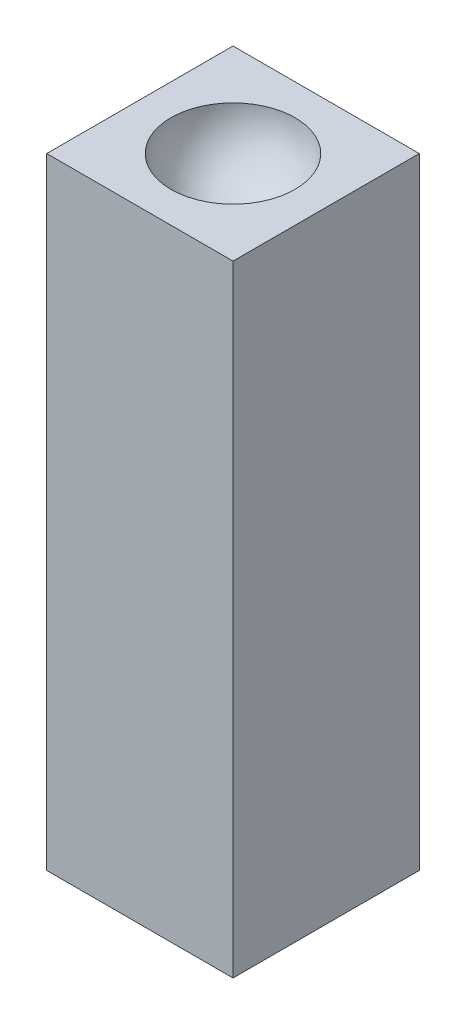
ISO-10303-21;
HEADER;
FILE_DESCRIPTION(('STEP AP214'),'2;1');
FILE_NAME('part.step','',(''),(''),'','','');
FILE_SCHEMA(('AUTOMOTIVE_DESIGN { 1 0 10303 214 1 1 1 1 }'));
ENDSEC;
DATA;
#1=APPLICATION_CONTEXT('core data for automotive mechanical design processes');
#2=APPLICATION_PROTOCOL_DEFINITION('international standard','automotive_design',2000,#1);
#3=PRODUCT_CONTEXT('',#1,'mechanical');
#4=PRODUCT('Part','Part','',(#3));
#5=PRODUCT_RELATED_PRODUCT_CATEGORY('part','',(#4));
#6=PRODUCT_DEFINITION_FORMATION('','',#4);
#7=PRODUCT_DEFINITION_CONTEXT('part definition',#1,'design');
#8=PRODUCT_DEFINITION('design','',#6,#7);
#9=PRODUCT_DEFINITION_SHAPE('','',#8);
#10=(LENGTH_UNIT() NAMED_UNIT(*) SI_UNIT(.MILLI.,.METRE.));
#11=(NAMED_UNIT(*) PLANE_ANGLE_UNIT() SI_UNIT($,.RADIAN.));
#12=(NAMED_UNIT(*) SI_UNIT($,.STERADIAN.) SOLID_ANGLE_UNIT());
#13=UNCERTAINTY_MEASURE_WITH_UNIT(LENGTH_MEASURE(1.E-05),#10,'distance_accuracy_value','');
#14=(GEOMETRIC_REPRESENTATION_CONTEXT(3) GLOBAL_UNCERTAINTY_ASSIGNED_CONTEXT((#13)) GLOBAL_UNIT_ASSIGNED_CONTEXT((#10,
#11,#12)) REPRESENTATION_CONTEXT('',''));
#15=CARTESIAN_POINT('',(0.,0.,0.));
#16=DIRECTION('',(0.,0.,1.));
#17=DIRECTION('',(1.,0.,0.));
#18=AXIS2_PLACEMENT_3D('',#15,#16,#17);
#19=CARTESIAN_POINT('',(3.,20.,-3.));
#20=DIRECTION('',(-1.,0.,0.));
#21=DIRECTION('',(0.,0.,1.));
#22=AXIS2_PLACEMENT_3D('',#19,#20,#21);
#23=PLANE('',#22);
#24=DIRECTION('',(0.,0.,-1.));
#25=VECTOR('',#24,1.);
#26=CARTESIAN_POINT('',(3.,0.,-3.));
#27=LINE('',#26,#25);
#28=CARTESIAN_POINT('',(3.,0.,3.));
#29=VERTEX_POINT('',#28);
#30=CARTESIAN_POINT('',(3.,0.,-3.));
#31=VERTEX_POINT('',#30);
#32=EDGE_CURVE('E115',#29,#31,#27,.T.);
#33=ORIENTED_EDGE('',*,*,#32,.T.);
#34=DIRECTION('',(0.,-1.,0.));
#35=VECTOR('',#34,1.);
#36=CARTESIAN_POINT('',(3.,20.,-3.));
#37=LINE('',#36,#35);
#38=CARTESIAN_POINT('',(3.,20.,-3.));
#39=VERTEX_POINT('',#38);
#40=EDGE_CURVE('E11',#39,#31,#37,.T.);
#41=ORIENTED_EDGE('',*,*,#40,.F.);
#42=DIRECTION('',(0.,0.,-1.));
#43=VECTOR('',#42,1.);
#44=CARTESIAN_POINT('',(3.,20.,-3.));
#45=LINE('',#44,#43);
#46=CARTESIAN_POINT('',(3.,20.,3.));
#47=VERTEX_POINT('',#46);
#48=EDGE_CURVE('E98',#47,#39,#45,.T.);
#49=ORIENTED_EDGE('',*,*,#48,.F.);
#50=DIRECTION('',(0.,-1.,0.));
#51=VECTOR('',#50,1.);
#52=CARTESIAN_POINT('',(3.,20.,3.));
#53=LINE('',#52,#51);
#54=EDGE_CURVE('E111',#47,#29,#53,.T.);
#55=ORIENTED_EDGE('',*,*,#54,.T.);
#56=EDGE_LOOP('',(#33,#41,#49,#55));
#57=FACE_BOUND('',#56,.T.);
#58=ADVANCED_FACE('F45',(#57),#23,.F.);
#59=CARTESIAN_POINT('',(-3.,20.,-3.));
#60=DIRECTION('',(0.,0.,1.));
#61=DIRECTION('',(1.,0.,0.));
#62=AXIS2_PLACEMENT_3D('',#59,#60,#61);
#63=PLANE('',#62);
#64=DIRECTION('',(-1.,0.,0.));
#65=VECTOR('',#64,1.);
#66=CARTESIAN_POINT('',(-3.,0.,-3.));
#67=LINE('',#66,#65);
#68=CARTESIAN_POINT('',(-3.,0.,-3.));
#69=VERTEX_POINT('',#68);
#70=EDGE_CURVE('E103',#31,#69,#67,.T.);
#71=ORIENTED_EDGE('',*,*,#70,.T.);
#72=DIRECTION('',(0.,-1.,0.));
#73=VECTOR('',#72,1.);
#74=CARTESIAN_POINT('',(-3.,20.,-3.));
#75=LINE('',#74,#73);
#76=CARTESIAN_POINT('',(-3.,20.,-3.));
#77=VERTEX_POINT('',#76);
#78=EDGE_CURVE('E55',#77,#69,#75,.T.);
#79=ORIENTED_EDGE('',*,*,#78,.F.);
#80=DIRECTION('',(-1.,0.,0.));
#81=VECTOR('',#80,1.);
#82=CARTESIAN_POINT('',(-3.,20.,-3.));
#83=LINE('',#82,#81);
#84=EDGE_CURVE('E93',#39,#77,#83,.T.);
#85=ORIENTED_EDGE('',*,*,#84,.F.);
#86=ORIENTED_EDGE('',*,*,#40,.T.);
#87=EDGE_LOOP('',(#71,#79,#85,#86));
#88=FACE_BOUND('',#87,.T.);
#89=ADVANCED_FACE('F102',(#88),#63,.F.);
#90=CARTESIAN_POINT('',(-3.,20.,-3.));
#91=DIRECTION('',(1.,0.,0.));
#92=DIRECTION('',(0.,0.,-1.));
#93=AXIS2_PLACEMENT_3D('',#90,#91,#92);
#94=PLANE('',#93);
#95=DIRECTION('',(0.,0.,1.));
#96=VECTOR('',#95,1.);
#97=CARTESIAN_POINT('',(-3.,0.,-3.));
#98=LINE('',#97,#96);
#99=CARTESIAN_POINT('',(-3.,0.,3.));
#100=VERTEX_POINT('',#99);
#101=EDGE_CURVE('E80',#69,#100,#98,.T.);
#102=ORIENTED_EDGE('',*,*,#101,.T.);
#103=DIRECTION('',(0.,-1.,0.));
#104=VECTOR('',#103,1.);
#105=CARTESIAN_POINT('',(-3.,20.,3.));
#106=LINE('',#105,#104);
#107=CARTESIAN_POINT('',(-3.,20.,3.));
#108=VERTEX_POINT('',#107);
#109=EDGE_CURVE('E105',#108,#100,#106,.T.);
#110=ORIENTED_EDGE('',*,*,#109,.F.);
#111=DIRECTION('',(0.,0.,1.));
#112=VECTOR('',#111,1.);
#113=CARTESIAN_POINT('',(-3.,20.,-3.));
#114=LINE('',#113,#112);
#115=EDGE_CURVE('E96',#77,#108,#114,.T.);
#116=ORIENTED_EDGE('',*,*,#115,.F.);
#117=ORIENTED_EDGE('',*,*,#78,.T.);
#118=EDGE_LOOP('',(#102,#110,#116,#117));
#119=FACE_BOUND('',#118,.T.);
#120=ADVANCED_FACE('F107',(#119),#94,.F.);
#121=CARTESIAN_POINT('',(-3.,20.,3.));
#122=DIRECTION('',(0.,0.,-1.));
#123=DIRECTION('',(-1.,0.,0.));
#124=AXIS2_PLACEMENT_3D('',#121,#122,#123);
#125=PLANE('',#124);
#126=DIRECTION('',(1.,0.,0.));
#127=VECTOR('',#126,1.);
#128=CARTESIAN_POINT('',(-3.,0.,3.));
#129=LINE('',#128,#127);
#130=EDGE_CURVE('E86',#100,#29,#129,.T.);
#131=ORIENTED_EDGE('',*,*,#130,.T.);
#132=ORIENTED_EDGE('',*,*,#54,.F.);
#133=DIRECTION('',(1.,0.,0.));
#134=VECTOR('',#133,1.);
#135=CARTESIAN_POINT('',(-3.,20.,3.));
#136=LINE('',#135,#134);
#137=EDGE_CURVE('E63',#108,#47,#136,.T.);
#138=ORIENTED_EDGE('',*,*,#137,.F.);
#139=ORIENTED_EDGE('',*,*,#109,.T.);
#140=EDGE_LOOP('',(#131,#132,#138,#139));
#141=FACE_BOUND('',#140,.T.);
#142=ADVANCED_FACE('F128',(#141),#125,.F.);
#143=CARTESIAN_POINT('',(0.,20.,0.));
#144=DIRECTION('',(0.,1.,0.));
#145=DIRECTION('',(0.,0.,1.));
#146=AXIS2_PLACEMENT_3D('',#143,#144,#145);
#147=PLANE('',#146);
#148=CARTESIAN_POINT('',(0.,20.,0.));
#149=DIRECTION('',(0.,1.,0.));
#150=DIRECTION('',(0.,0.,1.));
#151=AXIS2_PLACEMENT_3D('',#148,#149,#150);
#152=CIRCLE('',#151,2.);
#153=CARTESIAN_POINT('',(0.,20.,2.));
#154=VERTEX_POINT('',#153);
#155=EDGE_CURVE('E48',#154,#154,#152,.F.);
#156=ORIENTED_EDGE('',*,*,#155,.T.);
#157=EDGE_LOOP('',(#156));
#158=FACE_BOUND('',#157,.T.);
#159=ORIENTED_EDGE('',*,*,#48,.T.);
#160=ORIENTED_EDGE('',*,*,#84,.T.);
#161=ORIENTED_EDGE('',*,*,#115,.T.);
#162=ORIENTED_EDGE('',*,*,#137,.T.);
#163=EDGE_LOOP('',(#159,#160,#161,#162));
#164=FACE_BOUND('',#163,.T.);
#165=ADVANCED_FACE('F94',(#158,#164),#147,.T.);
#166=CARTESIAN_POINT('',(0.,0.,0.));
#167=DIRECTION('',(0.,1.,0.));
#168=DIRECTION('',(0.,0.,1.));
#169=AXIS2_PLACEMENT_3D('',#166,#167,#168);
#170=PLANE('',#169);
#171=ORIENTED_EDGE('',*,*,#32,.F.);
#172=ORIENTED_EDGE('',*,*,#130,.F.);
#173=ORIENTED_EDGE('',*,*,#101,.F.);
#174=ORIENTED_EDGE('',*,*,#70,.F.);
#175=EDGE_LOOP('',(#171,#172,#173,#174));
#176=FACE_BOUND('',#175,.T.);
#177=ADVANCED_FACE('F131',(#176),#170,.F.);
#178=CARTESIAN_POINT('',(0.,20.,0.));
#179=DIRECTION('',(-1.,0.,0.));
#180=DIRECTION('',(0.,0.,-1.));
#181=AXIS2_PLACEMENT_3D('',#178,#179,#180);
#182=SPHERICAL_SURFACE('',#181,2.);
#183=CARTESIAN_POINT('',(0.,20.,0.));
#184=DIRECTION('',(0.,1.,0.));
#185=DIRECTION('',(0.,0.,1.));
#186=AXIS2_PLACEMENT_3D('',#183,#184,#185);
#187=SPHERICAL_SURFACE('',#186,2.);
#188=ORIENTED_EDGE('',*,*,#155,.F.);
#189=EDGE_LOOP('',(#188));
#190=FACE_BOUND('',#189,.T.);
#191=ADVANCED_FACE('F139',(#190),#187,.F.);
#192=CLOSED_SHELL('',(#58,#89,#120,#142,#165,#177,#191));
#193=MANIFOLD_SOLID_BREP('B2',#192);
#194=ADVANCED_BREP_SHAPE_REPRESENTATION('',(#18,#193),#14);
#195=SHAPE_DEFINITION_REPRESENTATION(#9,#194);
ENDSEC;
END-ISO-10303-21;
